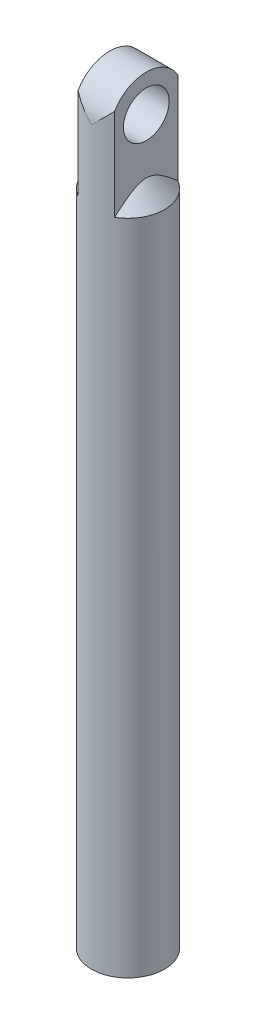
ISO-10303-21;
HEADER;
FILE_DESCRIPTION(('STEP AP214'),'2;1');
FILE_NAME('part.step','',(''),(''),'','','');
FILE_SCHEMA(('AUTOMOTIVE_DESIGN { 1 0 10303 214 1 1 1 1 }'));
ENDSEC;
DATA;
#1=APPLICATION_CONTEXT('core data for automotive mechanical design processes');
#2=APPLICATION_PROTOCOL_DEFINITION('international standard','automotive_design',2000,#1);
#3=PRODUCT_CONTEXT('',#1,'mechanical');
#4=PRODUCT('Part','Part','',(#3));
#5=PRODUCT_RELATED_PRODUCT_CATEGORY('part','',(#4));
#6=PRODUCT_DEFINITION_FORMATION('','',#4);
#7=PRODUCT_DEFINITION_CONTEXT('part definition',#1,'design');
#8=PRODUCT_DEFINITION('design','',#6,#7);
#9=PRODUCT_DEFINITION_SHAPE('','',#8);
#10=(LENGTH_UNIT() NAMED_UNIT(*) SI_UNIT(.MILLI.,.METRE.));
#11=(NAMED_UNIT(*) PLANE_ANGLE_UNIT() SI_UNIT($,.RADIAN.));
#12=(NAMED_UNIT(*) SI_UNIT($,.STERADIAN.) SOLID_ANGLE_UNIT());
#13=UNCERTAINTY_MEASURE_WITH_UNIT(LENGTH_MEASURE(1.E-05),#10,'distance_accuracy_value','');
#14=(GEOMETRIC_REPRESENTATION_CONTEXT(3) GLOBAL_UNCERTAINTY_ASSIGNED_CONTEXT((#13)) GLOBAL_UNIT_ASSIGNED_CONTEXT((#10,
#11,#12)) REPRESENTATION_CONTEXT('',''));
#15=CARTESIAN_POINT('',(0.,0.,0.));
#16=DIRECTION('',(0.,0.,1.));
#17=DIRECTION('',(1.,0.,0.));
#18=AXIS2_PLACEMENT_3D('',#15,#16,#17);
#19=CARTESIAN_POINT('',(-2.,60.0338881665019,0.));
#20=DIRECTION('',(1.,0.,0.));
#21=DIRECTION('',(0.,0.,-1.));
#22=AXIS2_PLACEMENT_3D('',#19,#20,#21);
#23=CYLINDRICAL_SURFACE('',#22,4.);
#24=CARTESIAN_POINT('',(2.,60.0338881665019,0.));
#25=DIRECTION('',(1.,0.,0.));
#26=DIRECTION('',(0.,0.,-1.));
#27=AXIS2_PLACEMENT_3D('',#24,#25,#26);
#28=CIRCLE('',#27,4.);
#29=CARTESIAN_POINT('',(2.,62.0338881665019,-3.46410161513775));
#30=VERTEX_POINT('',#29);
#31=CARTESIAN_POINT('',(2.,62.0338881665019,3.46410161513775));
#32=VERTEX_POINT('',#31);
#33=EDGE_CURVE('E115',#30,#32,#28,.T.);
#34=ORIENTED_EDGE('',*,*,#33,.F.);
#35=CARTESIAN_POINT('',(0.,60.0338881665019,0.));
#36=DIRECTION('',(0.707106781186547,-0.707106781186547,0.));
#37=DIRECTION('',(0.707106781186547,0.707106781186547,0.));
#38=AXIS2_PLACEMENT_3D('',#35,#36,#37);
#39=ELLIPSE('',#38,5.65685424949238,4.);
#40=CARTESIAN_POINT('',(0.,60.0338881665019,-4.));
#41=VERTEX_POINT('',#40);
#42=EDGE_CURVE('E104',#30,#41,#39,.F.);
#43=ORIENTED_EDGE('',*,*,#42,.T.);
#44=CARTESIAN_POINT('',(0.,60.0338881665019,0.));
#45=DIRECTION('',(0.707106781186547,0.707106781186547,0.));
#46=DIRECTION('',(0.707106781186547,-0.707106781186547,0.));
#47=AXIS2_PLACEMENT_3D('',#44,#45,#46);
#48=ELLIPSE('',#47,5.65685424949238,4.);
#49=CARTESIAN_POINT('',(-2.,62.0338881665019,-3.46410161513775));
#50=VERTEX_POINT('',#49);
#51=EDGE_CURVE('E92',#41,#50,#48,.T.);
#52=ORIENTED_EDGE('',*,*,#51,.T.);
#53=CARTESIAN_POINT('',(-2.,60.0338881665019,0.));
#54=DIRECTION('',(1.,0.,0.));
#55=DIRECTION('',(0.,0.,-1.));
#56=AXIS2_PLACEMENT_3D('',#53,#54,#55);
#57=CIRCLE('',#56,4.);
#58=CARTESIAN_POINT('',(-2.,62.0338881665019,3.46410161513775));
#59=VERTEX_POINT('',#58);
#60=EDGE_CURVE('E103',#50,#59,#57,.T.);
#61=ORIENTED_EDGE('',*,*,#60,.T.);
#62=CARTESIAN_POINT('',(0.,60.0338881665019,4.));
#63=VERTEX_POINT('',#62);
#64=EDGE_CURVE('E105',#59,#63,#48,.T.);
#65=ORIENTED_EDGE('',*,*,#64,.T.);
#66=EDGE_CURVE('E167',#63,#32,#39,.F.);
#67=ORIENTED_EDGE('',*,*,#66,.T.);
#68=EDGE_LOOP('',(#34,#43,#52,#61,#65,#67));
#69=FACE_BOUND('',#68,.T.);
#70=ADVANCED_FACE('F43',(#69),#23,.T.);
#71=CARTESIAN_POINT('',(-2.,60.0338881665019,0.));
#72=DIRECTION('',(1.,0.,0.));
#73=DIRECTION('',(0.,0.,-1.));
#74=AXIS2_PLACEMENT_3D('',#71,#72,#73);
#75=PLANE('',#74);
#76=CARTESIAN_POINT('',(-2.,60.0338881665019,0.));
#77=DIRECTION('',(1.,0.,0.));
#78=DIRECTION('',(0.,0.,-1.));
#79=AXIS2_PLACEMENT_3D('',#76,#77,#78);
#80=CIRCLE('',#79,2.5);
#81=CARTESIAN_POINT('',(-2.,60.0338881665019,-2.5));
#82=VERTEX_POINT('',#81);
#83=EDGE_CURVE('E109',#82,#82,#80,.T.);
#84=ORIENTED_EDGE('',*,*,#83,.T.);
#85=EDGE_LOOP('',(#84));
#86=FACE_BOUND('',#85,.T.);
#87=DIRECTION('',(0.,-1.,0.));
#88=VECTOR('',#87,1.);
#89=CARTESIAN_POINT('',(-2.,64.0338881665019,3.46410161513775));
#90=LINE('',#89,#88);
#91=CARTESIAN_POINT('',(-2.,52.,3.46410161513775));
#92=VERTEX_POINT('',#91);
#93=EDGE_CURVE('E64',#59,#92,#90,.T.);
#94=ORIENTED_EDGE('',*,*,#93,.F.);
#95=ORIENTED_EDGE('',*,*,#60,.F.);
#96=DIRECTION('',(0.,-1.,0.));
#97=VECTOR('',#96,1.);
#98=CARTESIAN_POINT('',(-2.,64.0338881665019,-3.46410161513775));
#99=LINE('',#98,#97);
#100=CARTESIAN_POINT('',(-2.,52.,-3.46410161513775));
#101=VERTEX_POINT('',#100);
#102=EDGE_CURVE('E89',#101,#50,#99,.F.);
#103=ORIENTED_EDGE('',*,*,#102,.F.);
#104=CARTESIAN_POINT('',(-2.,52.,-3.46410161513775));
#105=CARTESIAN_POINT('',(-2.,52.0963790612018,-3.35275396211319));
#106=CARTESIAN_POINT('',(-2.,52.1921562962059,-3.24087103857294));
#107=CARTESIAN_POINT('',(-2.,52.382019091863,-3.01555536218821));
#108=CARTESIAN_POINT('',(-2.,52.4761034986545,-2.90212163855928));
#109=CARTESIAN_POINT('',(-2.,52.664391843326,-2.67038284862291));
#110=CARTESIAN_POINT('',(-2.,52.7585347091699,-2.55202793453257));
#111=CARTESIAN_POINT('',(-2.,52.9433947856529,-2.31271173982874));
#112=CARTESIAN_POINT('',(-2.,53.0341130581871,-2.19175128571782));
#113=CARTESIAN_POINT('',(-2.,53.1967679764711,-1.96552138553555));
#114=CARTESIAN_POINT('',(-2.,53.2694179993579,-1.86076822135655));
#115=CARTESIAN_POINT('',(-2.,53.4098077529234,-1.64788374568867));
#116=CARTESIAN_POINT('',(-2.,53.4775441095744,-1.53975018457013));
#117=CARTESIAN_POINT('',(-2.,53.6052467247621,-1.32013556950235));
#118=CARTESIAN_POINT('',(-2.,53.6652738402786,-1.20869055115103));
#119=CARTESIAN_POINT('',(-2.,53.7746957714476,-0.980801885215452));
#120=CARTESIAN_POINT('',(-2.,53.8241079360026,-0.86436677285245));
#121=CARTESIAN_POINT('',(-2.,53.9064467311557,-0.628340376426924));
#122=CARTESIAN_POINT('',(-2.,53.9397088794497,-0.508873010863526));
#123=CARTESIAN_POINT('',(-2.,53.9743339091561,-0.326928092542203));
#124=CARTESIAN_POINT('',(-2.,53.9833295843749,-0.265880960010054));
#125=CARTESIAN_POINT('',(-2.,53.9958027802413,-0.143235833655841));
#126=CARTESIAN_POINT('',(-2.,53.9992827213431,-0.0816380933960034));
#127=CARTESIAN_POINT('',(-2.,54.0005045049471,0.0403620564869246));
#128=CARTESIAN_POINT('',(-2.,53.9983614038687,0.100763345860643));
#129=CARTESIAN_POINT('',(-2.,53.9887121218778,0.221073392910287));
#130=CARTESIAN_POINT('',(-2.,53.9812106868548,0.28098253901701));
#131=CARTESIAN_POINT('',(-2.,53.9590668021486,0.412926339070151));
#132=CARTESIAN_POINT('',(-2.,53.9432245744732,0.484758911617068));
#133=CARTESIAN_POINT('',(-2.,53.9052179878417,0.626739703904052));
#134=CARTESIAN_POINT('',(-2.,53.8830498222574,0.696886881820127));
#135=CARTESIAN_POINT('',(-2.,53.8332496275462,0.836113790954348));
#136=CARTESIAN_POINT('',(-2.,53.805556820065,0.90517149313949));
#137=CARTESIAN_POINT('',(-2.,53.7459506378502,1.0413859594632));
#138=CARTESIAN_POINT('',(-2.,53.7140388266443,1.10854341667769));
#139=CARTESIAN_POINT('',(-2.,53.6249738854804,1.28440833238797));
#140=CARTESIAN_POINT('',(-2.,53.5649330398342,1.39164684747604));
#141=CARTESIAN_POINT('',(-2.,53.4386264543894,1.60241690056724));
#142=CARTESIAN_POINT('',(-2.,53.3723562492451,1.70594570480267));
#143=CARTESIAN_POINT('',(-2.,53.2352247903927,1.9104312481165));
#144=CARTESIAN_POINT('',(-2.,53.1643480057218,2.01137749709442));
#145=CARTESIAN_POINT('',(-2.,53.0194395379406,2.21098290208203));
#146=CARTESIAN_POINT('',(-2.,52.9454074451537,2.30964175851963));
#147=CARTESIAN_POINT('',(-2.,52.800352224205,2.49822084082912));
#148=CARTESIAN_POINT('',(-2.,52.7294885403695,2.58826425092264));
#149=CARTESIAN_POINT('',(-2.,52.5861992374266,2.76710967484137));
#150=CARTESIAN_POINT('',(-2.,52.5137734794883,2.85591157716061));
#151=CARTESIAN_POINT('',(-2.,52.3683243497494,3.03174766803905));
#152=CARTESIAN_POINT('',(-2.,52.2953113730796,3.11879047768977));
#153=CARTESIAN_POINT('',(-2.,52.1483238435001,3.29203230573859));
#154=CARTESIAN_POINT('',(-2.,52.0743494780615,3.37823148306433));
#155=CARTESIAN_POINT('',(-2.,52.,3.46410161513776));
#156=B_SPLINE_CURVE_WITH_KNOTS('',3,(#104,#105,#106,#107,#108,#109,#110,#111,#112,#113,#114,
#115,#116,#117,#118,#119,#120,#121,#122,#123,#124,#125,#126,#127,#128,#129,#130,#131,#132,#133,
#134,#135,#136,#137,#138,#139,#140,#141,#142,#143,#144,#145,#146,#147,#148,#149,#150,#151,#152,
#153,#154,#155),.UNSPECIFIED.,.F.,.F.,(4,2,2,2,2,2,2,2,2,2,2,2,2,2,2,2,2,2,2,2,2,2,2,2,2,4),(0.,
0.441811704023208,0.883913943135334,1.3375643248885,1.79107286389759,2.17341687568895,
2.55602099099016,2.93539001113443,3.31413419833165,3.68463191778775,3.86953457319009,
4.05435606579214,4.23542544873249,4.41633465661562,4.63666034164417,4.85711888807201,
5.08015170668846,5.30310210168503,5.67146768277466,6.04009936007348,6.41004575687892,
6.78004033371566,7.12377096527096,7.46753227316915,7.80835610196405,8.14911443854908),.UNSPECIFIED.);
#157=EDGE_CURVE('E12',#101,#92,#156,.T.);
#158=ORIENTED_EDGE('',*,*,#157,.T.);
#159=EDGE_LOOP('',(#94,#95,#103,#158));
#160=FACE_BOUND('',#159,.T.);
#161=ADVANCED_FACE('F107',(#86,#160),#75,.F.);
#162=CARTESIAN_POINT('',(2.,60.0338881665019,0.));
#163=DIRECTION('',(1.,0.,0.));
#164=DIRECTION('',(0.,0.,-1.));
#165=AXIS2_PLACEMENT_3D('',#162,#163,#164);
#166=PLANE('',#165);
#167=CARTESIAN_POINT('',(2.,60.0338881665019,0.));
#168=DIRECTION('',(1.,0.,0.));
#169=DIRECTION('',(0.,0.,-1.));
#170=AXIS2_PLACEMENT_3D('',#167,#168,#169);
#171=CIRCLE('',#170,2.5);
#172=CARTESIAN_POINT('',(2.,60.0338881665019,-2.5));
#173=VERTEX_POINT('',#172);
#174=EDGE_CURVE('E154',#173,#173,#171,.T.);
#175=ORIENTED_EDGE('',*,*,#174,.F.);
#176=EDGE_LOOP('',(#175));
#177=FACE_BOUND('',#176,.T.);
#178=ORIENTED_EDGE('',*,*,#33,.T.);
#179=DIRECTION('',(0.,-1.,0.));
#180=VECTOR('',#179,1.);
#181=CARTESIAN_POINT('',(2.,64.0338881665019,3.46410161513775));
#182=LINE('',#181,#180);
#183=CARTESIAN_POINT('',(2.,52.,3.46410161513775));
#184=VERTEX_POINT('',#183);
#185=EDGE_CURVE('E155',#32,#184,#182,.T.);
#186=ORIENTED_EDGE('',*,*,#185,.T.);
#187=CARTESIAN_POINT('',(2.,52.,3.46410161513775));
#188=CARTESIAN_POINT('',(2.,52.0610964437988,3.39355002138217));
#189=CARTESIAN_POINT('',(2.,52.1219299501231,3.3227719084861));
#190=CARTESIAN_POINT('',(2.,52.2429679718541,3.18067208242656));
#191=CARTESIAN_POINT('',(2.,52.3031724454107,3.10935033363379));
#192=CARTESIAN_POINT('',(2.,52.482949154243,2.89412023633247));
#193=CARTESIAN_POINT('',(2.,52.6014042916261,2.74926888218004));
#194=CARTESIAN_POINT('',(2.,52.780142228485,2.523839726347));
#195=CARTESIAN_POINT('',(2.,52.8419987309919,2.44451012727254));
#196=CARTESIAN_POINT('',(2.,52.9640855646589,2.28461154087906));
#197=CARTESIAN_POINT('',(2.,53.0243159792457,2.20404261747796));
#198=CARTESIAN_POINT('',(2.,53.1426516149241,2.04145700524417));
#199=CARTESIAN_POINT('',(2.,53.2007586029023,1.95944160834842));
#200=CARTESIAN_POINT('',(2.,53.3142588237763,1.79356169986058));
#201=CARTESIAN_POINT('',(2.,53.3696524119399,1.70969743243885));
#202=CARTESIAN_POINT('',(2.,53.4863676211703,1.52459889089569));
#203=CARTESIAN_POINT('',(2.,53.5469972115591,1.42292279759993));
#204=CARTESIAN_POINT('',(2.,53.6612047761876,1.21551011026593));
#205=CARTESIAN_POINT('',(2.,53.7147771866844,1.10977039637741));
#206=CARTESIAN_POINT('',(2.,53.8105774640489,0.895835572288688));
#207=CARTESIAN_POINT('',(2.,53.8530212065158,0.787739619195043));
#208=CARTESIAN_POINT('',(2.,53.9237556195476,0.567108861020087));
#209=CARTESIAN_POINT('',(2.,53.952081684434,0.454585927624468));
#210=CARTESIAN_POINT('',(2.,53.9878513708559,0.241380374831055));
#211=CARTESIAN_POINT('',(2.,53.9975528037413,0.14108863426539));
#212=CARTESIAN_POINT('',(2.,54.0016216668434,-0.0598178890373114));
#213=CARTESIAN_POINT('',(2.,53.9959926204655,-0.160432592239098));
#214=CARTESIAN_POINT('',(2.,53.9740139420054,-0.33110724559513));
#215=CARTESIAN_POINT('',(2.,53.9611997841269,-0.401658599154255));
#216=CARTESIAN_POINT('',(2.,53.9291576410404,-0.541295318071335));
#217=CARTESIAN_POINT('',(2.,53.909927854673,-0.610380265942678));
#218=CARTESIAN_POINT('',(2.,53.8657985169887,-0.747739298437278));
#219=CARTESIAN_POINT('',(2.,53.8408243066608,-0.815988995145656));
#220=CARTESIAN_POINT('',(2.,53.7864214589642,-0.950640456772849));
#221=CARTESIAN_POINT('',(2.,53.7569941884032,-1.01704278133979));
#222=CARTESIAN_POINT('',(2.,53.6706505890572,-1.19845367999141));
#223=CARTESIAN_POINT('',(2.,53.6099678430387,-1.3116615399296));
#224=CARTESIAN_POINT('',(2.,53.4811899157014,-1.53381418848149));
#225=CARTESIAN_POINT('',(2.,53.4130874089045,-1.64275461699258));
#226=CARTESIAN_POINT('',(2.,53.2714784109916,-1.85779399365074));
#227=CARTESIAN_POINT('',(2.,53.1979473530215,-1.96387663136204));
#228=CARTESIAN_POINT('',(2.,53.0473170876049,-2.17339074781669));
#229=CARTESIAN_POINT('',(2.,52.9702193240179,-2.27682327347102));
#230=CARTESIAN_POINT('',(2.,52.8202833886175,-2.47269161638548));
#231=CARTESIAN_POINT('',(2.,52.7476646904057,-2.5652962702629));
#232=CARTESIAN_POINT('',(2.,52.6007470951657,-2.7491769656496));
#233=CARTESIAN_POINT('',(2.,52.526448005661,-2.84045285297024));
#234=CARTESIAN_POINT('',(2.,52.3773511172649,-3.02095201688059));
#235=CARTESIAN_POINT('',(2.,52.3025672203315,-3.11018680897033));
#236=CARTESIAN_POINT('',(2.,52.1519863027476,-3.2877630628511));
#237=CARTESIAN_POINT('',(2.,52.0761895182859,-3.37610472474828));
#238=CARTESIAN_POINT('',(2.,52.,-3.46410161513776));
#239=B_SPLINE_CURVE_WITH_KNOTS('',3,(#187,#188,#189,#190,#191,#192,#193,#194,#195,#196,#197,
#198,#199,#200,#201,#202,#203,#204,#205,#206,#207,#208,#209,#210,#211,#212,#213,#214,#215,#216,
#217,#218,#219,#220,#221,#222,#223,#224,#225,#226,#227,#228,#229,#230,#231,#232,#233,#234,#235,
#236,#237,#238),.UNSPECIFIED.,.F.,.F.,(4,2,2,2,2,2,2,2,2,2,2,2,2,2,2,2,2,2,2,2,2,2,2,2,2,4),(0.,
0.279983925781855,0.559986361940465,1.12127162038151,1.42304209201935,1.72479705174004,
2.02629492471187,2.32775321622251,2.68269867222512,3.03792230660999,3.38563677018125,
3.73247504032009,4.03366297581601,4.33478169510229,4.54958711746106,4.76445289630912,
4.9822871000033,5.20005457748899,5.58492308134545,5.97017506681502,6.35729223312258,
6.74425403654526,7.09727684443315,7.45034029532164,7.79961595957207,8.14881155238973),.UNSPECIFIED.);
#240=CARTESIAN_POINT('',(2.,52.,-3.46410161513775));
#241=VERTEX_POINT('',#240);
#242=EDGE_CURVE('E112',#184,#241,#239,.T.);
#243=ORIENTED_EDGE('',*,*,#242,.T.);
#244=DIRECTION('',(0.,-1.,0.));
#245=VECTOR('',#244,1.);
#246=CARTESIAN_POINT('',(2.,64.0338881665019,-3.46410161513775));
#247=LINE('',#246,#245);
#248=EDGE_CURVE('E159',#241,#30,#247,.F.);
#249=ORIENTED_EDGE('',*,*,#248,.T.);
#250=EDGE_LOOP('',(#178,#186,#243,#249));
#251=FACE_BOUND('',#250,.T.);
#252=ADVANCED_FACE('F128',(#177,#251),#166,.T.);
#253=CARTESIAN_POINT('',(-2.,60.0338881665019,0.));
#254=DIRECTION('',(1.,0.,0.));
#255=DIRECTION('',(0.,0.,-1.));
#256=AXIS2_PLACEMENT_3D('',#253,#254,#255);
#257=CYLINDRICAL_SURFACE('',#256,2.5);
#258=ORIENTED_EDGE('',*,*,#83,.F.);
#259=EDGE_LOOP('',(#258));
#260=FACE_BOUND('',#259,.T.);
#261=ORIENTED_EDGE('',*,*,#174,.T.);
#262=EDGE_LOOP('',(#261));
#263=FACE_BOUND('',#262,.T.);
#264=ADVANCED_FACE('F133',(#260,#263),#257,.F.);
#265=CARTESIAN_POINT('',(0.,-20.,0.));
#266=DIRECTION('',(0.,-1.,0.));
#267=DIRECTION('',(0.,0.,-1.));
#268=AXIS2_PLACEMENT_3D('',#265,#266,#267);
#269=PLANE('',#268);
#270=CARTESIAN_POINT('',(0.,-20.,0.));
#271=DIRECTION('',(0.,-1.,0.));
#272=DIRECTION('',(0.,0.,-1.));
#273=AXIS2_PLACEMENT_3D('',#270,#271,#272);
#274=CIRCLE('',#273,4.);
#275=CARTESIAN_POINT('',(0.,-20.,-4.));
#276=VERTEX_POINT('',#275);
#277=EDGE_CURVE('E153',#276,#276,#274,.T.);
#278=ORIENTED_EDGE('',*,*,#277,.T.);
#279=EDGE_LOOP('',(#278));
#280=FACE_BOUND('',#279,.T.);
#281=ADVANCED_FACE('F135',(#280),#269,.T.);
#282=CARTESIAN_POINT('',(0.,55.,0.));
#283=DIRECTION('',(0.,-1.,0.));
#284=DIRECTION('',(0.,0.,-1.));
#285=AXIS2_PLACEMENT_3D('',#282,#283,#284);
#286=CYLINDRICAL_SURFACE('',#285,4.);
#287=ORIENTED_EDGE('',*,*,#277,.F.);
#288=EDGE_LOOP('',(#287));
#289=FACE_BOUND('',#288,.T.);
#290=ORIENTED_EDGE('',*,*,#93,.T.);
#291=CARTESIAN_POINT('',(0.,52.,0.));
#292=DIRECTION('',(0.,1.,0.));
#293=DIRECTION('',(0.,0.,1.));
#294=AXIS2_PLACEMENT_3D('',#291,#292,#293);
#295=CIRCLE('',#294,4.);
#296=EDGE_CURVE('E58',#92,#101,#295,.F.);
#297=ORIENTED_EDGE('',*,*,#296,.T.);
#298=ORIENTED_EDGE('',*,*,#102,.T.);
#299=ORIENTED_EDGE('',*,*,#51,.F.);
#300=ORIENTED_EDGE('',*,*,#42,.F.);
#301=ORIENTED_EDGE('',*,*,#248,.F.);
#302=CARTESIAN_POINT('',(0.,52.,0.));
#303=DIRECTION('',(0.,1.,0.));
#304=DIRECTION('',(0.,0.,1.));
#305=AXIS2_PLACEMENT_3D('',#302,#303,#304);
#306=CIRCLE('',#305,4.);
#307=EDGE_CURVE('E108',#241,#184,#306,.F.);
#308=ORIENTED_EDGE('',*,*,#307,.T.);
#309=ORIENTED_EDGE('',*,*,#185,.F.);
#310=ORIENTED_EDGE('',*,*,#66,.F.);
#311=ORIENTED_EDGE('',*,*,#64,.F.);
#312=EDGE_LOOP('',(#290,#297,#298,#299,#300,#301,#308,#309,#310,#311));
#313=FACE_BOUND('',#312,.T.);
#314=ADVANCED_FACE('F91',(#289,#313),#286,.T.);
#315=CARTESIAN_POINT('',(0.,55.,0.));
#316=DIRECTION('',(0.,-1.,0.));
#317=DIRECTION('',(0.,0.,-1.));
#318=AXIS2_PLACEMENT_3D('',#315,#316,#317);
#319=CONICAL_SURFACE('',#318,0.999999999999948,0.785398163397453);
#320=ORIENTED_EDGE('',*,*,#242,.F.);
#321=ORIENTED_EDGE('',*,*,#307,.F.);
#322=EDGE_LOOP('',(#320,#321));
#323=FACE_BOUND('',#322,.T.);
#324=ADVANCED_FACE('F125',(#323),#319,.T.);
#325=CARTESIAN_POINT('',(0.,55.,0.));
#326=DIRECTION('',(0.,-1.,0.));
#327=DIRECTION('',(0.,0.,-1.));
#328=AXIS2_PLACEMENT_3D('',#325,#326,#327);
#329=CONICAL_SURFACE('',#328,0.999999999999948,0.785398163397453);
#330=ORIENTED_EDGE('',*,*,#157,.F.);
#331=ORIENTED_EDGE('',*,*,#296,.F.);
#332=EDGE_LOOP('',(#330,#331));
#333=FACE_BOUND('',#332,.T.);
#334=ADVANCED_FACE('F45',(#333),#329,.T.);
#335=CLOSED_SHELL('',(#70,#161,#252,#264,#281,#314,#324,#334));
#336=MANIFOLD_SOLID_BREP('B2',#335);
#337=ADVANCED_BREP_SHAPE_REPRESENTATION('',(#18,#336),#14);
#338=SHAPE_DEFINITION_REPRESENTATION(#9,#337);
ENDSEC;
END-ISO-10303-21;
